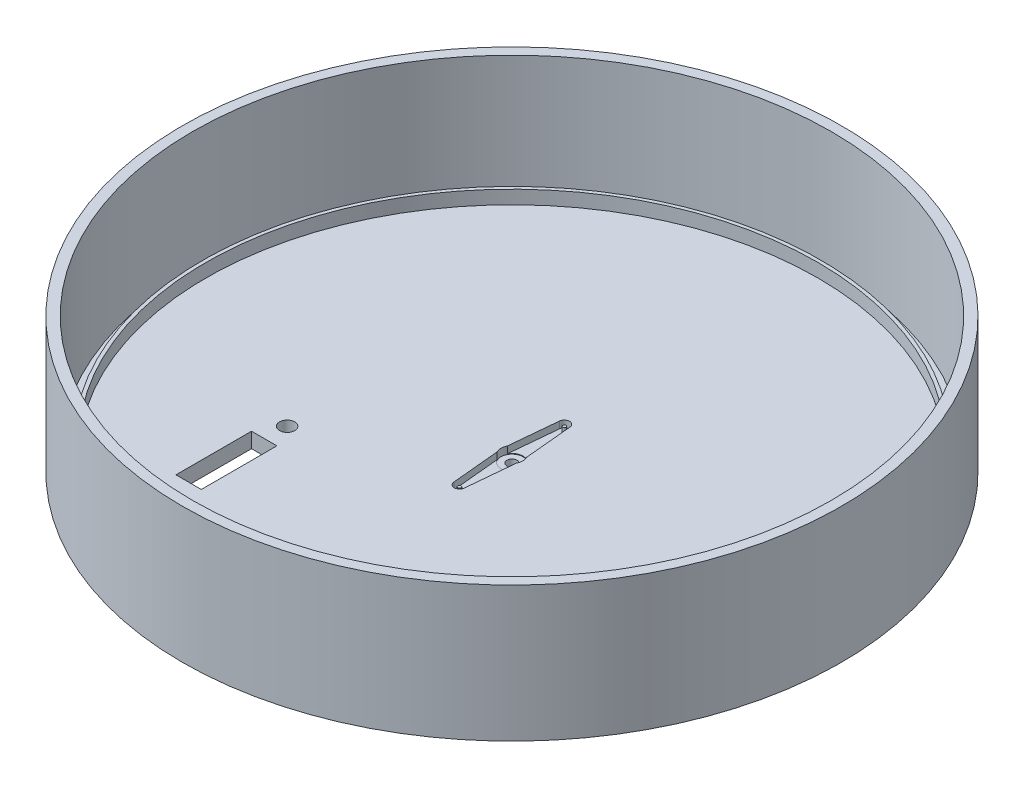
ISO-10303-21;
HEADER;
FILE_DESCRIPTION(('STEP AP214'),'2;1');
FILE_NAME('part.step','',(''),(''),'','','');
FILE_SCHEMA(('AUTOMOTIVE_DESIGN { 1 0 10303 214 1 1 1 1 }'));
ENDSEC;
DATA;
#1=APPLICATION_CONTEXT('core data for automotive mechanical design processes');
#2=APPLICATION_PROTOCOL_DEFINITION('international standard','automotive_design',2000,#1);
#3=PRODUCT_CONTEXT('',#1,'mechanical');
#4=PRODUCT('Part','Part','',(#3));
#5=PRODUCT_RELATED_PRODUCT_CATEGORY('part','',(#4));
#6=PRODUCT_DEFINITION_FORMATION('','',#4);
#7=PRODUCT_DEFINITION_CONTEXT('part definition',#1,'design');
#8=PRODUCT_DEFINITION('design','',#6,#7);
#9=PRODUCT_DEFINITION_SHAPE('','',#8);
#10=(LENGTH_UNIT() NAMED_UNIT(*) SI_UNIT(.MILLI.,.METRE.));
#11=(NAMED_UNIT(*) PLANE_ANGLE_UNIT() SI_UNIT($,.RADIAN.));
#12=(NAMED_UNIT(*) SI_UNIT($,.STERADIAN.) SOLID_ANGLE_UNIT());
#13=UNCERTAINTY_MEASURE_WITH_UNIT(LENGTH_MEASURE(1.E-05),#10,'distance_accuracy_value','');
#14=(GEOMETRIC_REPRESENTATION_CONTEXT(3) GLOBAL_UNCERTAINTY_ASSIGNED_CONTEXT((#13)) GLOBAL_UNIT_ASSIGNED_CONTEXT((#10,
#11,#12)) REPRESENTATION_CONTEXT('',''));
#15=CARTESIAN_POINT('',(0.,0.,0.));
#16=DIRECTION('',(0.,0.,1.));
#17=DIRECTION('',(1.,0.,0.));
#18=AXIS2_PLACEMENT_3D('',#15,#16,#17);
#19=CARTESIAN_POINT('',(0.,4.5,0.));
#20=DIRECTION('',(0.,1.,0.));
#21=DIRECTION('',(0.,0.,1.));
#22=AXIS2_PLACEMENT_3D('',#19,#20,#21);
#23=PLANE('',#22);
#24=DIRECTION('',(-1.,0.,0.));
#25=VECTOR('',#24,1.);
#26=CARTESIAN_POINT('',(-37.,4.5,54.8972675047795));
#27=LINE('',#26,#25);
#28=CARTESIAN_POINT('',(-37.,4.5,54.8972675047795));
#29=VERTEX_POINT('',#28);
#30=CARTESIAN_POINT('',(-44.5,4.5,54.8972675047795));
#31=VERTEX_POINT('',#30);
#32=EDGE_CURVE('E212',#29,#31,#27,.T.);
#33=ORIENTED_EDGE('',*,*,#32,.T.);
#34=DIRECTION('',(0.,0.,-1.));
#35=VECTOR('',#34,1.);
#36=CARTESIAN_POINT('',(-44.5,4.5,54.8972675047795));
#37=LINE('',#36,#35);
#38=CARTESIAN_POINT('',(-44.5,4.5,32.5372675047795));
#39=VERTEX_POINT('',#38);
#40=EDGE_CURVE('E191',#31,#39,#37,.T.);
#41=ORIENTED_EDGE('',*,*,#40,.T.);
#42=DIRECTION('',(-1.,0.,0.));
#43=VECTOR('',#42,1.);
#44=CARTESIAN_POINT('',(-37.,4.5,32.5372675047795));
#45=LINE('',#44,#43);
#46=CARTESIAN_POINT('',(-37.,4.5,32.5372675047795));
#47=VERTEX_POINT('',#46);
#48=EDGE_CURVE('E218',#47,#39,#45,.T.);
#49=ORIENTED_EDGE('',*,*,#48,.F.);
#50=DIRECTION('',(0.,0.,1.));
#51=VECTOR('',#50,1.);
#52=CARTESIAN_POINT('',(-37.,4.5,32.5372675047795));
#53=LINE('',#52,#51);
#54=EDGE_CURVE('E215',#47,#29,#53,.T.);
#55=ORIENTED_EDGE('',*,*,#54,.T.);
#56=EDGE_LOOP('',(#33,#41,#49,#55));
#57=FACE_BOUND('',#56,.T.);
#58=CARTESIAN_POINT('',(40.5,4.5,64.));
#59=DIRECTION('',(0.,1.,0.));
#60=DIRECTION('',(0.,0.,1.));
#61=AXIS2_PLACEMENT_3D('',#58,#59,#60);
#62=CIRCLE('',#61,2.25000000000001);
#63=CARTESIAN_POINT('',(40.5,4.5,66.25));
#64=VERTEX_POINT('',#63);
#65=EDGE_CURVE('E220',#64,#64,#62,.T.);
#66=ORIENTED_EDGE('',*,*,#65,.F.);
#67=EDGE_LOOP('',(#66));
#68=FACE_BOUND('',#67,.T.);
#69=CARTESIAN_POINT('',(40.5,4.5,26.));
#70=DIRECTION('',(0.,1.,0.));
#71=DIRECTION('',(0.,0.,1.));
#72=AXIS2_PLACEMENT_3D('',#69,#70,#71);
#73=CIRCLE('',#72,2.25);
#74=CARTESIAN_POINT('',(40.5,4.5,28.25));
#75=VERTEX_POINT('',#74);
#76=EDGE_CURVE('E227',#75,#75,#73,.F.);
#77=ORIENTED_EDGE('',*,*,#76,.T.);
#78=EDGE_LOOP('',(#77));
#79=FACE_BOUND('',#78,.T.);
#80=CARTESIAN_POINT('',(0.,4.5,0.));
#81=DIRECTION('',(0.,1.,0.));
#82=DIRECTION('',(0.,0.,1.));
#83=AXIS2_PLACEMENT_3D('',#80,#81,#82);
#84=CIRCLE('',#83,3.25);
#85=CARTESIAN_POINT('',(2.8699087192043,4.5,1.52516357923835));
#86=VERTEX_POINT('',#85);
#87=CARTESIAN_POINT('',(2.8699087192043,4.5,-1.52516357923835));
#88=VERTEX_POINT('',#87);
#89=EDGE_CURVE('E274',#86,#88,#84,.T.);
#90=ORIENTED_EDGE('',*,*,#89,.F.);
#91=DIRECTION('',(0.0935483870967743,0.,-0.995614734358423));
#92=VECTOR('',#91,1.);
#93=CARTESIAN_POINT('',(2.8699087192043,4.5,1.52516357923835));
#94=LINE('',#93,#92);
#95=CARTESIAN_POINT('',(1.54320283825555,4.5,15.645));
#96=VERTEX_POINT('',#95);
#97=EDGE_CURVE('E279',#96,#86,#94,.T.);
#98=ORIENTED_EDGE('',*,*,#97,.F.);
#99=CARTESIAN_POINT('',(0.,4.5,15.5));
#100=DIRECTION('',(0.,1.,0.));
#101=DIRECTION('',(0.,0.,-1.));
#102=AXIS2_PLACEMENT_3D('',#99,#100,#101);
#103=CIRCLE('',#102,1.55);
#104=CARTESIAN_POINT('',(-1.54320283825555,4.5,15.645));
#105=VERTEX_POINT('',#104);
#106=EDGE_CURVE('E311',#105,#96,#103,.T.);
#107=ORIENTED_EDGE('',*,*,#106,.F.);
#108=DIRECTION('',(0.0935483870967743,0.,0.995614734358422));
#109=VECTOR('',#108,1.);
#110=CARTESIAN_POINT('',(-2.8699087192043,4.5,1.52516357923835));
#111=LINE('',#110,#109);
#112=CARTESIAN_POINT('',(-2.8699087192043,4.5,1.52516357923835));
#113=VERTEX_POINT('',#112);
#114=EDGE_CURVE('E308',#113,#105,#111,.T.);
#115=ORIENTED_EDGE('',*,*,#114,.F.);
#116=CARTESIAN_POINT('',(0.,4.5,0.));
#117=DIRECTION('',(0.,1.,0.));
#118=DIRECTION('',(0.,0.,1.));
#119=AXIS2_PLACEMENT_3D('',#116,#117,#118);
#120=CIRCLE('',#119,3.25);
#121=CARTESIAN_POINT('',(-2.8699087192043,4.5,-1.52516357923835));
#122=VERTEX_POINT('',#121);
#123=EDGE_CURVE('E305',#122,#113,#120,.T.);
#124=ORIENTED_EDGE('',*,*,#123,.F.);
#125=DIRECTION('',(-0.0935483870967743,0.,0.995614734358422));
#126=VECTOR('',#125,1.);
#127=CARTESIAN_POINT('',(-2.8699087192043,4.5,-1.52516357923835));
#128=LINE('',#127,#126);
#129=CARTESIAN_POINT('',(-1.54320283825555,4.5,-15.645));
#130=VERTEX_POINT('',#129);
#131=EDGE_CURVE('E302',#130,#122,#128,.T.);
#132=ORIENTED_EDGE('',*,*,#131,.F.);
#133=CARTESIAN_POINT('',(0.,4.5,-15.5));
#134=DIRECTION('',(0.,1.,0.));
#135=DIRECTION('',(0.,0.,1.));
#136=AXIS2_PLACEMENT_3D('',#133,#134,#135);
#137=CIRCLE('',#136,1.55);
#138=CARTESIAN_POINT('',(1.54320283825556,4.5,-15.645));
#139=VERTEX_POINT('',#138);
#140=EDGE_CURVE('E299',#139,#130,#137,.T.);
#141=ORIENTED_EDGE('',*,*,#140,.F.);
#142=DIRECTION('',(-0.0935483870967743,0.,-0.995614734358423));
#143=VECTOR('',#142,1.);
#144=CARTESIAN_POINT('',(2.8699087192043,4.5,-1.52516357923835));
#145=LINE('',#144,#143);
#146=EDGE_CURVE('E296',#88,#139,#145,.T.);
#147=ORIENTED_EDGE('',*,*,#146,.F.);
#148=EDGE_LOOP('',(#90,#98,#107,#115,#124,#132,#141,#147));
#149=FACE_BOUND('',#148,.T.);
#150=CARTESIAN_POINT('',(0.,4.5,0.));
#151=DIRECTION('',(0.,1.,0.));
#152=DIRECTION('',(0.,0.,1.));
#153=AXIS2_PLACEMENT_3D('',#150,#151,#152);
#154=CIRCLE('',#153,90.5);
#155=CARTESIAN_POINT('',(0.,4.5,90.5));
#156=VERTEX_POINT('',#155);
#157=EDGE_CURVE('E11',#156,#156,#154,.F.);
#158=ORIENTED_EDGE('',*,*,#157,.F.);
#159=EDGE_LOOP('',(#158));
#160=FACE_BOUND('',#159,.T.);
#161=CARTESIAN_POINT('',(-40.5,4.5,64.));
#162=DIRECTION('',(0.,1.,0.));
#163=DIRECTION('',(0.,0.,1.));
#164=AXIS2_PLACEMENT_3D('',#161,#162,#163);
#165=CIRCLE('',#164,2.25000000000001);
#166=CARTESIAN_POINT('',(-40.5,4.5,66.25));
#167=VERTEX_POINT('',#166);
#168=EDGE_CURVE('E224',#167,#167,#165,.F.);
#169=ORIENTED_EDGE('',*,*,#168,.T.);
#170=EDGE_LOOP('',(#169));
#171=FACE_BOUND('',#170,.T.);
#172=CARTESIAN_POINT('',(-40.5,4.5,26.));
#173=DIRECTION('',(0.,1.,0.));
#174=DIRECTION('',(0.,0.,1.));
#175=AXIS2_PLACEMENT_3D('',#172,#173,#174);
#176=CIRCLE('',#175,2.25);
#177=CARTESIAN_POINT('',(-40.5,4.5,28.25));
#178=VERTEX_POINT('',#177);
#179=EDGE_CURVE('E170',#178,#178,#176,.T.);
#180=ORIENTED_EDGE('',*,*,#179,.F.);
#181=EDGE_LOOP('',(#180));
#182=FACE_BOUND('',#181,.T.);
#183=DIRECTION('',(1.,0.,0.));
#184=VECTOR('',#183,1.);
#185=CARTESIAN_POINT('',(0.,4.5,32.5372675047795));
#186=LINE('',#185,#184);
#187=CARTESIAN_POINT('',(37.,4.5,32.5372675047795));
#188=VERTEX_POINT('',#187);
#189=CARTESIAN_POINT('',(44.5,4.5,32.5372675047795));
#190=VERTEX_POINT('',#189);
#191=EDGE_CURVE('E174',#188,#190,#186,.T.);
#192=ORIENTED_EDGE('',*,*,#191,.T.);
#193=DIRECTION('',(0.,0.,-1.));
#194=VECTOR('',#193,1.);
#195=CARTESIAN_POINT('',(44.5,4.5,0.));
#196=LINE('',#195,#194);
#197=CARTESIAN_POINT('',(44.5,4.5,54.8972675047795));
#198=VERTEX_POINT('',#197);
#199=EDGE_CURVE('E156',#198,#190,#196,.T.);
#200=ORIENTED_EDGE('',*,*,#199,.F.);
#201=DIRECTION('',(1.,0.,0.));
#202=VECTOR('',#201,1.);
#203=CARTESIAN_POINT('',(0.,4.5,54.8972675047795));
#204=LINE('',#203,#202);
#205=CARTESIAN_POINT('',(37.,4.5,54.8972675047795));
#206=VERTEX_POINT('',#205);
#207=EDGE_CURVE('E167',#206,#198,#204,.T.);
#208=ORIENTED_EDGE('',*,*,#207,.F.);
#209=DIRECTION('',(0.,0.,1.));
#210=VECTOR('',#209,1.);
#211=CARTESIAN_POINT('',(37.,4.5,0.));
#212=LINE('',#211,#210);
#213=EDGE_CURVE('E54',#188,#206,#212,.T.);
#214=ORIENTED_EDGE('',*,*,#213,.F.);
#215=EDGE_LOOP('',(#192,#200,#208,#214));
#216=FACE_BOUND('',#215,.T.);
#217=ADVANCED_FACE('F39',(#57,#68,#79,#149,#160,#171,#182,#216),#23,.T.);
#218=CARTESIAN_POINT('',(0.,0.,0.));
#219=DIRECTION('',(0.,1.,0.));
#220=DIRECTION('',(0.,0.,1.));
#221=AXIS2_PLACEMENT_3D('',#218,#219,#220);
#222=PLANE('',#221);
#223=CARTESIAN_POINT('',(-40.5,0.,26.));
#224=DIRECTION('',(0.,1.,0.));
#225=DIRECTION('',(0.,0.,1.));
#226=AXIS2_PLACEMENT_3D('',#223,#224,#225);
#227=CIRCLE('',#226,2.25);
#228=CARTESIAN_POINT('',(-40.5,0.,28.25));
#229=VERTEX_POINT('',#228);
#230=EDGE_CURVE('E233',#229,#229,#227,.T.);
#231=ORIENTED_EDGE('',*,*,#230,.T.);
#232=EDGE_LOOP('',(#231));
#233=FACE_BOUND('',#232,.T.);
#234=CARTESIAN_POINT('',(40.5,0.,64.));
#235=DIRECTION('',(0.,1.,0.));
#236=DIRECTION('',(0.,0.,1.));
#237=AXIS2_PLACEMENT_3D('',#234,#235,#236);
#238=CIRCLE('',#237,2.25000000000001);
#239=CARTESIAN_POINT('',(40.5,0.,66.25));
#240=VERTEX_POINT('',#239);
#241=EDGE_CURVE('E223',#240,#240,#238,.T.);
#242=ORIENTED_EDGE('',*,*,#241,.T.);
#243=EDGE_LOOP('',(#242));
#244=FACE_BOUND('',#243,.T.);
#245=CARTESIAN_POINT('',(0.,0.,0.));
#246=DIRECTION('',(0.,1.,0.));
#247=DIRECTION('',(0.,0.,1.));
#248=AXIS2_PLACEMENT_3D('',#245,#246,#247);
#249=CIRCLE('',#248,97.5);
#250=CARTESIAN_POINT('',(0.,0.,97.5));
#251=VERTEX_POINT('',#250);
#252=EDGE_CURVE('E338',#251,#251,#249,.T.);
#253=ORIENTED_EDGE('',*,*,#252,.F.);
#254=EDGE_LOOP('',(#253));
#255=FACE_BOUND('',#254,.T.);
#256=CARTESIAN_POINT('',(0.,0.,0.));
#257=DIRECTION('',(0.,-1.,0.));
#258=DIRECTION('',(0.,0.,-1.));
#259=AXIS2_PLACEMENT_3D('',#256,#257,#258);
#260=CIRCLE('',#259,1.5);
#261=CARTESIAN_POINT('',(0.,0.,-1.5));
#262=VERTEX_POINT('',#261);
#263=EDGE_CURVE('E271',#262,#262,#260,.T.);
#264=ORIENTED_EDGE('',*,*,#263,.F.);
#265=EDGE_LOOP('',(#264));
#266=FACE_BOUND('',#265,.T.);
#267=CARTESIAN_POINT('',(40.5,0.,26.));
#268=DIRECTION('',(0.,-1.,0.));
#269=DIRECTION('',(0.,0.,-1.));
#270=AXIS2_PLACEMENT_3D('',#267,#268,#269);
#271=CIRCLE('',#270,2.25);
#272=CARTESIAN_POINT('',(40.5,0.,23.75));
#273=VERTEX_POINT('',#272);
#274=EDGE_CURVE('E238',#273,#273,#271,.T.);
#275=ORIENTED_EDGE('',*,*,#274,.F.);
#276=EDGE_LOOP('',(#275));
#277=FACE_BOUND('',#276,.T.);
#278=CARTESIAN_POINT('',(-40.5,0.,64.));
#279=DIRECTION('',(0.,-1.,0.));
#280=DIRECTION('',(0.,0.,-1.));
#281=AXIS2_PLACEMENT_3D('',#278,#279,#280);
#282=CIRCLE('',#281,2.25000000000001);
#283=CARTESIAN_POINT('',(-40.5,0.,61.75));
#284=VERTEX_POINT('',#283);
#285=EDGE_CURVE('E230',#284,#284,#282,.T.);
#286=ORIENTED_EDGE('',*,*,#285,.F.);
#287=EDGE_LOOP('',(#286));
#288=FACE_BOUND('',#287,.T.);
#289=DIRECTION('',(0.,0.,-1.));
#290=VECTOR('',#289,1.);
#291=CARTESIAN_POINT('',(-44.5,0.,54.8972675047795));
#292=LINE('',#291,#290);
#293=CARTESIAN_POINT('',(-44.5,0.,54.8972675047795));
#294=VERTEX_POINT('',#293);
#295=CARTESIAN_POINT('',(-44.5,0.,32.5372675047795));
#296=VERTEX_POINT('',#295);
#297=EDGE_CURVE('E208',#294,#296,#292,.T.);
#298=ORIENTED_EDGE('',*,*,#297,.F.);
#299=DIRECTION('',(-1.,0.,0.));
#300=VECTOR('',#299,1.);
#301=CARTESIAN_POINT('',(-37.,0.,54.8972675047795));
#302=LINE('',#301,#300);
#303=CARTESIAN_POINT('',(-37.,0.,54.8972675047795));
#304=VERTEX_POINT('',#303);
#305=EDGE_CURVE('E210',#304,#294,#302,.T.);
#306=ORIENTED_EDGE('',*,*,#305,.F.);
#307=DIRECTION('',(0.,0.,1.));
#308=VECTOR('',#307,1.);
#309=CARTESIAN_POINT('',(-37.,0.,32.5372675047795));
#310=LINE('',#309,#308);
#311=CARTESIAN_POINT('',(-37.,0.,32.5372675047795));
#312=VERTEX_POINT('',#311);
#313=EDGE_CURVE('E198',#312,#304,#310,.T.);
#314=ORIENTED_EDGE('',*,*,#313,.F.);
#315=DIRECTION('',(-1.,0.,0.));
#316=VECTOR('',#315,1.);
#317=CARTESIAN_POINT('',(-37.,0.,32.5372675047795));
#318=LINE('',#317,#316);
#319=EDGE_CURVE('E205',#312,#296,#318,.T.);
#320=ORIENTED_EDGE('',*,*,#319,.T.);
#321=EDGE_LOOP('',(#298,#306,#314,#320));
#322=FACE_BOUND('',#321,.T.);
#323=DIRECTION('',(0.,0.,-1.));
#324=VECTOR('',#323,1.);
#325=CARTESIAN_POINT('',(44.5,0.,0.));
#326=LINE('',#325,#324);
#327=CARTESIAN_POINT('',(44.5,0.,54.8972675047795));
#328=VERTEX_POINT('',#327);
#329=CARTESIAN_POINT('',(44.5,0.,32.5372675047795));
#330=VERTEX_POINT('',#329);
#331=EDGE_CURVE('E159',#328,#330,#326,.T.);
#332=ORIENTED_EDGE('',*,*,#331,.T.);
#333=DIRECTION('',(1.,0.,0.));
#334=VECTOR('',#333,1.);
#335=CARTESIAN_POINT('',(0.,0.,32.5372675047795));
#336=LINE('',#335,#334);
#337=CARTESIAN_POINT('',(37.,0.,32.5372675047795));
#338=VERTEX_POINT('',#337);
#339=EDGE_CURVE('E164',#338,#330,#336,.T.);
#340=ORIENTED_EDGE('',*,*,#339,.F.);
#341=DIRECTION('',(0.,0.,1.));
#342=VECTOR('',#341,1.);
#343=CARTESIAN_POINT('',(37.,0.,0.));
#344=LINE('',#343,#342);
#345=CARTESIAN_POINT('',(37.,0.,54.8972675047795));
#346=VERTEX_POINT('',#345);
#347=EDGE_CURVE('E182',#338,#346,#344,.T.);
#348=ORIENTED_EDGE('',*,*,#347,.T.);
#349=DIRECTION('',(1.,0.,0.));
#350=VECTOR('',#349,1.);
#351=CARTESIAN_POINT('',(0.,0.,54.8972675047795));
#352=LINE('',#351,#350);
#353=EDGE_CURVE('E176',#346,#328,#352,.T.);
#354=ORIENTED_EDGE('',*,*,#353,.T.);
#355=EDGE_LOOP('',(#332,#340,#348,#354));
#356=FACE_BOUND('',#355,.T.);
#357=ADVANCED_FACE('F358',(#233,#244,#255,#266,#277,#288,#322,#356),#222,.F.);
#358=CARTESIAN_POINT('',(0.,2.5,0.));
#359=DIRECTION('',(0.,1.,0.));
#360=DIRECTION('',(0.,0.,1.));
#361=AXIS2_PLACEMENT_3D('',#358,#359,#360);
#362=PLANE('',#361);
#363=CARTESIAN_POINT('',(0.,2.5,-15.5));
#364=DIRECTION('',(0.,1.,0.));
#365=DIRECTION('',(0.,0.,1.));
#366=AXIS2_PLACEMENT_3D('',#363,#364,#365);
#367=CIRCLE('',#366,0.48);
#368=CARTESIAN_POINT('',(0.,2.5,-15.02));
#369=VERTEX_POINT('',#368);
#370=EDGE_CURVE('E256',#369,#369,#367,.T.);
#371=ORIENTED_EDGE('',*,*,#370,.F.);
#372=EDGE_LOOP('',(#371));
#373=FACE_BOUND('',#372,.T.);
#374=CARTESIAN_POINT('',(0.,2.5,0.));
#375=DIRECTION('',(0.,1.,0.));
#376=DIRECTION('',(0.,0.,1.));
#377=AXIS2_PLACEMENT_3D('',#374,#375,#376);
#378=CIRCLE('',#377,3.25);
#379=CARTESIAN_POINT('',(2.8699087192043,2.5,-1.52516357923834));
#380=VERTEX_POINT('',#379);
#381=CARTESIAN_POINT('',(-2.8699087192043,2.5,-1.52516357923835));
#382=VERTEX_POINT('',#381);
#383=EDGE_CURVE('E269',#380,#382,#378,.T.);
#384=ORIENTED_EDGE('',*,*,#383,.F.);
#385=DIRECTION('',(-0.0935483870967743,0.,-0.995614734358423));
#386=VECTOR('',#385,1.);
#387=CARTESIAN_POINT('',(2.8699087192043,2.5,-1.52516357923835));
#388=LINE('',#387,#386);
#389=CARTESIAN_POINT('',(1.54320283825556,2.5,-15.645));
#390=VERTEX_POINT('',#389);
#391=EDGE_CURVE('E275',#380,#390,#388,.T.);
#392=ORIENTED_EDGE('',*,*,#391,.T.);
#393=CARTESIAN_POINT('',(0.,2.5,-15.5));
#394=DIRECTION('',(0.,1.,0.));
#395=DIRECTION('',(0.,0.,1.));
#396=AXIS2_PLACEMENT_3D('',#393,#394,#395);
#397=CIRCLE('',#396,1.55);
#398=CARTESIAN_POINT('',(-1.54320283825555,2.5,-15.645));
#399=VERTEX_POINT('',#398);
#400=EDGE_CURVE('E278',#390,#399,#397,.T.);
#401=ORIENTED_EDGE('',*,*,#400,.T.);
#402=DIRECTION('',(-0.0935483870967743,0.,0.995614734358422));
#403=VECTOR('',#402,1.);
#404=CARTESIAN_POINT('',(-2.8699087192043,2.5,-1.52516357923835));
#405=LINE('',#404,#403);
#406=EDGE_CURVE('E282',#399,#382,#405,.T.);
#407=ORIENTED_EDGE('',*,*,#406,.T.);
#408=EDGE_LOOP('',(#384,#392,#401,#407));
#409=FACE_BOUND('',#408,.T.);
#410=ADVANCED_FACE('F349',(#373,#409),#362,.T.);
#411=CARTESIAN_POINT('',(0.,40.001,0.));
#412=DIRECTION('',(0.,-1.,0.));
#413=DIRECTION('',(0.,0.,-1.));
#414=AXIS2_PLACEMENT_3D('',#411,#412,#413);
#415=CYLINDRICAL_SURFACE('',#414,1.5);
#416=ORIENTED_EDGE('',*,*,#263,.T.);
#417=EDGE_LOOP('',(#416));
#418=FACE_BOUND('',#417,.T.);
#419=CARTESIAN_POINT('',(0.,2.3,0.));
#420=DIRECTION('',(0.,1.,0.));
#421=DIRECTION('',(0.,0.,1.));
#422=AXIS2_PLACEMENT_3D('',#419,#420,#421);
#423=CIRCLE('',#422,1.5);
#424=CARTESIAN_POINT('',(0.,2.3,1.5));
#425=VERTEX_POINT('',#424);
#426=EDGE_CURVE('E268',#425,#425,#423,.F.);
#427=ORIENTED_EDGE('',*,*,#426,.F.);
#428=EDGE_LOOP('',(#427));
#429=FACE_BOUND('',#428,.T.);
#430=ADVANCED_FACE('F347',(#418,#429),#415,.F.);
#431=CARTESIAN_POINT('',(0.,40.,0.));
#432=DIRECTION('',(0.,-1.,0.));
#433=DIRECTION('',(0.,0.,-1.));
#434=AXIS2_PLACEMENT_3D('',#431,#432,#433);
#435=CYLINDRICAL_SURFACE('',#434,97.5);
#436=CARTESIAN_POINT('',(0.,40.,0.));
#437=DIRECTION('',(0.,1.,0.));
#438=DIRECTION('',(0.,0.,1.));
#439=AXIS2_PLACEMENT_3D('',#436,#437,#438);
#440=CIRCLE('',#439,97.5);
#441=CARTESIAN_POINT('',(0.,40.,97.5));
#442=VERTEX_POINT('',#441);
#443=EDGE_CURVE('E47',#442,#442,#440,.T.);
#444=ORIENTED_EDGE('',*,*,#443,.F.);
#445=EDGE_LOOP('',(#444));
#446=FACE_BOUND('',#445,.T.);
#447=ORIENTED_EDGE('',*,*,#252,.T.);
#448=EDGE_LOOP('',(#447));
#449=FACE_BOUND('',#448,.T.);
#450=ADVANCED_FACE('F41',(#446,#449),#435,.T.);
#451=CARTESIAN_POINT('',(0.,40.,0.));
#452=DIRECTION('',(0.,1.,0.));
#453=DIRECTION('',(0.,0.,1.));
#454=AXIS2_PLACEMENT_3D('',#451,#452,#453);
#455=PLANE('',#454);
#456=CARTESIAN_POINT('',(0.,40.,0.));
#457=DIRECTION('',(0.,1.,0.));
#458=DIRECTION('',(0.,0.,1.));
#459=AXIS2_PLACEMENT_3D('',#456,#457,#458);
#460=CIRCLE('',#459,94.5);
#461=CARTESIAN_POINT('',(0.,40.,94.5));
#462=VERTEX_POINT('',#461);
#463=EDGE_CURVE('E335',#462,#462,#460,.T.);
#464=ORIENTED_EDGE('',*,*,#463,.F.);
#465=EDGE_LOOP('',(#464));
#466=FACE_BOUND('',#465,.T.);
#467=ORIENTED_EDGE('',*,*,#443,.T.);
#468=EDGE_LOOP('',(#467));
#469=FACE_BOUND('',#468,.T.);
#470=ADVANCED_FACE('F356',(#466,#469),#455,.T.);
#471=CARTESIAN_POINT('',(0.,40.,0.));
#472=DIRECTION('',(0.,-1.,0.));
#473=DIRECTION('',(0.,0.,-1.));
#474=AXIS2_PLACEMENT_3D('',#471,#472,#473);
#475=CYLINDRICAL_SURFACE('',#474,94.5);
#476=ORIENTED_EDGE('',*,*,#463,.T.);
#477=EDGE_LOOP('',(#476));
#478=FACE_BOUND('',#477,.T.);
#479=CARTESIAN_POINT('',(0.,4.5,0.));
#480=DIRECTION('',(0.,1.,0.));
#481=DIRECTION('',(0.,0.,1.));
#482=AXIS2_PLACEMENT_3D('',#479,#480,#481);
#483=CIRCLE('',#482,94.5);
#484=CARTESIAN_POINT('',(0.,4.5,94.5));
#485=VERTEX_POINT('',#484);
#486=EDGE_CURVE('E318',#485,#485,#483,.T.);
#487=ORIENTED_EDGE('',*,*,#486,.F.);
#488=EDGE_LOOP('',(#487));
#489=FACE_BOUND('',#488,.T.);
#490=ADVANCED_FACE('F376',(#478,#489),#475,.F.);
#491=CARTESIAN_POINT('',(0.,4.5,0.));
#492=DIRECTION('',(0.,1.,0.));
#493=DIRECTION('',(0.,0.,1.));
#494=AXIS2_PLACEMENT_3D('',#491,#492,#493);
#495=CIRCLE('',#494,91.5);
#496=CARTESIAN_POINT('',(0.,4.5,91.5));
#497=VERTEX_POINT('',#496);
#498=EDGE_CURVE('E246',#497,#497,#495,.T.);
#499=ORIENTED_EDGE('',*,*,#498,.F.);
#500=EDGE_LOOP('',(#499));
#501=FACE_BOUND('',#500,.T.);
#502=ORIENTED_EDGE('',*,*,#486,.T.);
#503=EDGE_LOOP('',(#502));
#504=FACE_BOUND('',#503,.T.);
#505=ADVANCED_FACE('F366',(#501,#504),#23,.T.);
#506=CARTESIAN_POINT('',(0.,2.5,0.));
#507=DIRECTION('',(0.,1.,0.));
#508=DIRECTION('',(0.,0.,1.));
#509=AXIS2_PLACEMENT_3D('',#506,#507,#508);
#510=CYLINDRICAL_SURFACE('',#509,3.25);
#511=ORIENTED_EDGE('',*,*,#89,.T.);
#512=DIRECTION('',(0.,1.,0.));
#513=VECTOR('',#512,1.);
#514=CARTESIAN_POINT('',(2.8699087192043,2.5,-1.52516357923835));
#515=LINE('',#514,#513);
#516=EDGE_CURVE('E294',#380,#88,#515,.T.);
#517=ORIENTED_EDGE('',*,*,#516,.F.);
#518=ORIENTED_EDGE('',*,*,#383,.T.);
#519=DIRECTION('',(0.,1.,0.));
#520=VECTOR('',#519,1.);
#521=CARTESIAN_POINT('',(-2.8699087192043,2.5,-1.52516357923835));
#522=LINE('',#521,#520);
#523=EDGE_CURVE('E325',#382,#122,#522,.T.);
#524=ORIENTED_EDGE('',*,*,#523,.T.);
#525=ORIENTED_EDGE('',*,*,#123,.T.);
#526=DIRECTION('',(0.,1.,0.));
#527=VECTOR('',#526,1.);
#528=CARTESIAN_POINT('',(-2.8699087192043,2.5,1.52516357923835));
#529=LINE('',#528,#527);
#530=CARTESIAN_POINT('',(-2.8699087192043,2.5,1.52516357923835));
#531=VERTEX_POINT('',#530);
#532=EDGE_CURVE('E323',#531,#113,#529,.T.);
#533=ORIENTED_EDGE('',*,*,#532,.F.);
#534=CARTESIAN_POINT('',(2.8699087192043,2.5,1.52516357923834));
#535=VERTEX_POINT('',#534);
#536=EDGE_CURVE('E262',#531,#535,#378,.T.);
#537=ORIENTED_EDGE('',*,*,#536,.T.);
#538=DIRECTION('',(0.,1.,0.));
#539=VECTOR('',#538,1.);
#540=CARTESIAN_POINT('',(2.8699087192043,2.5,1.52516357923835));
#541=LINE('',#540,#539);
#542=EDGE_CURVE('E316',#535,#86,#541,.T.);
#543=ORIENTED_EDGE('',*,*,#542,.T.);
#544=EDGE_LOOP('',(#511,#517,#518,#524,#525,#533,#537,#543));
#545=FACE_BOUND('',#544,.T.);
#546=CARTESIAN_POINT('',(0.,2.3,0.));
#547=DIRECTION('',(0.,1.,0.));
#548=DIRECTION('',(0.,0.,1.));
#549=AXIS2_PLACEMENT_3D('',#546,#547,#548);
#550=CIRCLE('',#549,3.25);
#551=CARTESIAN_POINT('',(0.,2.3,3.25));
#552=VERTEX_POINT('',#551);
#553=EDGE_CURVE('E265',#552,#552,#550,.T.);
#554=ORIENTED_EDGE('',*,*,#553,.F.);
#555=EDGE_LOOP('',(#554));
#556=FACE_BOUND('',#555,.T.);
#557=ADVANCED_FACE('F375',(#545,#556),#510,.F.);
#558=CARTESIAN_POINT('',(2.8699087192043,2.5,1.52516357923835));
#559=DIRECTION('',(0.995614734358423,0.,0.0935483870967743));
#560=DIRECTION('',(0.0935483870967743,0.,-0.995614734358423));
#561=AXIS2_PLACEMENT_3D('',#558,#559,#560);
#562=PLANE('',#561);
#563=ORIENTED_EDGE('',*,*,#97,.T.);
#564=ORIENTED_EDGE('',*,*,#542,.F.);
#565=DIRECTION('',(0.0935483870967743,0.,-0.995614734358423));
#566=VECTOR('',#565,1.);
#567=CARTESIAN_POINT('',(2.8699087192043,2.5,1.52516357923835));
#568=LINE('',#567,#566);
#569=CARTESIAN_POINT('',(1.54320283825555,2.5,15.645));
#570=VERTEX_POINT('',#569);
#571=EDGE_CURVE('E291',#570,#535,#568,.T.);
#572=ORIENTED_EDGE('',*,*,#571,.F.);
#573=DIRECTION('',(0.,1.,0.));
#574=VECTOR('',#573,1.);
#575=CARTESIAN_POINT('',(1.54320283825555,2.5,15.645));
#576=LINE('',#575,#574);
#577=EDGE_CURVE('E319',#570,#96,#576,.T.);
#578=ORIENTED_EDGE('',*,*,#577,.T.);
#579=EDGE_LOOP('',(#563,#564,#572,#578));
#580=FACE_BOUND('',#579,.T.);
#581=ADVANCED_FACE('F382',(#580),#562,.F.);
#582=CARTESIAN_POINT('',(0.,2.5,15.5));
#583=DIRECTION('',(0.,1.,0.));
#584=DIRECTION('',(0.,0.,1.));
#585=AXIS2_PLACEMENT_3D('',#582,#583,#584);
#586=CYLINDRICAL_SURFACE('',#585,1.55);
#587=ORIENTED_EDGE('',*,*,#106,.T.);
#588=ORIENTED_EDGE('',*,*,#577,.F.);
#589=CARTESIAN_POINT('',(0.,2.5,15.5));
#590=DIRECTION('',(0.,1.,0.));
#591=DIRECTION('',(0.,0.,-1.));
#592=AXIS2_PLACEMENT_3D('',#589,#590,#591);
#593=CIRCLE('',#592,1.55);
#594=CARTESIAN_POINT('',(-1.54320283825555,2.5,15.645));
#595=VERTEX_POINT('',#594);
#596=EDGE_CURVE('E288',#595,#570,#593,.T.);
#597=ORIENTED_EDGE('',*,*,#596,.F.);
#598=DIRECTION('',(0.,1.,0.));
#599=VECTOR('',#598,1.);
#600=CARTESIAN_POINT('',(-1.54320283825555,2.5,15.645));
#601=LINE('',#600,#599);
#602=EDGE_CURVE('E321',#595,#105,#601,.T.);
#603=ORIENTED_EDGE('',*,*,#602,.T.);
#604=EDGE_LOOP('',(#587,#588,#597,#603));
#605=FACE_BOUND('',#604,.T.);
#606=ADVANCED_FACE('F443',(#605),#586,.F.);
#607=CARTESIAN_POINT('',(-2.8699087192043,2.5,1.52516357923835));
#608=DIRECTION('',(-0.995614734358423,0.,0.0935483870967743));
#609=DIRECTION('',(0.0935483870967743,0.,0.995614734358423));
#610=AXIS2_PLACEMENT_3D('',#607,#608,#609);
#611=PLANE('',#610);
#612=ORIENTED_EDGE('',*,*,#114,.T.);
#613=ORIENTED_EDGE('',*,*,#602,.F.);
#614=DIRECTION('',(0.0935483870967743,0.,0.995614734358422));
#615=VECTOR('',#614,1.);
#616=CARTESIAN_POINT('',(-2.8699087192043,2.5,1.52516357923835));
#617=LINE('',#616,#615);
#618=EDGE_CURVE('E285',#531,#595,#617,.T.);
#619=ORIENTED_EDGE('',*,*,#618,.F.);
#620=ORIENTED_EDGE('',*,*,#532,.T.);
#621=EDGE_LOOP('',(#612,#613,#619,#620));
#622=FACE_BOUND('',#621,.T.);
#623=ADVANCED_FACE('F447',(#622),#611,.F.);
#624=CARTESIAN_POINT('',(-2.8699087192043,2.5,-1.52516357923835));
#625=DIRECTION('',(-0.995614734358423,0.,-0.0935483870967743));
#626=DIRECTION('',(-0.0935483870967743,0.,0.995614734358423));
#627=AXIS2_PLACEMENT_3D('',#624,#625,#626);
#628=PLANE('',#627);
#629=ORIENTED_EDGE('',*,*,#131,.T.);
#630=ORIENTED_EDGE('',*,*,#523,.F.);
#631=ORIENTED_EDGE('',*,*,#406,.F.);
#632=DIRECTION('',(0.,1.,0.));
#633=VECTOR('',#632,1.);
#634=CARTESIAN_POINT('',(-1.54320283825555,2.5,-15.645));
#635=LINE('',#634,#633);
#636=EDGE_CURVE('E327',#399,#130,#635,.T.);
#637=ORIENTED_EDGE('',*,*,#636,.T.);
#638=EDGE_LOOP('',(#629,#630,#631,#637));
#639=FACE_BOUND('',#638,.T.);
#640=ADVANCED_FACE('F451',(#639),#628,.F.);
#641=CARTESIAN_POINT('',(0.,2.5,-15.5));
#642=DIRECTION('',(0.,1.,0.));
#643=DIRECTION('',(0.,0.,1.));
#644=AXIS2_PLACEMENT_3D('',#641,#642,#643);
#645=CYLINDRICAL_SURFACE('',#644,1.55);
#646=ORIENTED_EDGE('',*,*,#140,.T.);
#647=ORIENTED_EDGE('',*,*,#636,.F.);
#648=ORIENTED_EDGE('',*,*,#400,.F.);
#649=DIRECTION('',(0.,1.,0.));
#650=VECTOR('',#649,1.);
#651=CARTESIAN_POINT('',(1.54320283825556,2.5,-15.645));
#652=LINE('',#651,#650);
#653=EDGE_CURVE('E329',#390,#139,#652,.T.);
#654=ORIENTED_EDGE('',*,*,#653,.T.);
#655=EDGE_LOOP('',(#646,#647,#648,#654));
#656=FACE_BOUND('',#655,.T.);
#657=ADVANCED_FACE('F435',(#656),#645,.F.);
#658=CARTESIAN_POINT('',(2.8699087192043,2.5,-1.52516357923835));
#659=DIRECTION('',(0.995614734358423,0.,-0.0935483870967743));
#660=DIRECTION('',(-0.0935483870967743,0.,-0.995614734358423));
#661=AXIS2_PLACEMENT_3D('',#658,#659,#660);
#662=PLANE('',#661);
#663=ORIENTED_EDGE('',*,*,#146,.T.);
#664=ORIENTED_EDGE('',*,*,#653,.F.);
#665=ORIENTED_EDGE('',*,*,#391,.F.);
#666=ORIENTED_EDGE('',*,*,#516,.T.);
#667=EDGE_LOOP('',(#663,#664,#665,#666));
#668=FACE_BOUND('',#667,.T.);
#669=ADVANCED_FACE('F428',(#668),#662,.F.);
#670=CARTESIAN_POINT('',(0.,2.5,15.5));
#671=DIRECTION('',(0.,1.,0.));
#672=DIRECTION('',(0.,0.,1.));
#673=AXIS2_PLACEMENT_3D('',#670,#671,#672);
#674=CIRCLE('',#673,0.48);
#675=CARTESIAN_POINT('',(0.,2.5,15.98));
#676=VERTEX_POINT('',#675);
#677=EDGE_CURVE('E250',#676,#676,#674,.T.);
#678=ORIENTED_EDGE('',*,*,#677,.F.);
#679=EDGE_LOOP('',(#678));
#680=FACE_BOUND('',#679,.T.);
#681=ORIENTED_EDGE('',*,*,#536,.F.);
#682=ORIENTED_EDGE('',*,*,#618,.T.);
#683=ORIENTED_EDGE('',*,*,#596,.T.);
#684=ORIENTED_EDGE('',*,*,#571,.T.);
#685=EDGE_LOOP('',(#681,#682,#683,#684));
#686=FACE_BOUND('',#685,.T.);
#687=ADVANCED_FACE('F361',(#680,#686),#362,.T.);
#688=CARTESIAN_POINT('',(0.,2.3,0.));
#689=DIRECTION('',(0.,1.,0.));
#690=DIRECTION('',(0.,0.,1.));
#691=AXIS2_PLACEMENT_3D('',#688,#689,#690);
#692=PLANE('',#691);
#693=ORIENTED_EDGE('',*,*,#553,.T.);
#694=EDGE_LOOP('',(#693));
#695=FACE_BOUND('',#694,.T.);
#696=ORIENTED_EDGE('',*,*,#426,.T.);
#697=EDGE_LOOP('',(#696));
#698=FACE_BOUND('',#697,.T.);
#699=ADVANCED_FACE('F345',(#695,#698),#692,.T.);
#700=CARTESIAN_POINT('',(0.,4.,-15.5));
#701=DIRECTION('',(0.,-1.,0.));
#702=DIRECTION('',(0.,0.,-1.));
#703=AXIS2_PLACEMENT_3D('',#700,#701,#702);
#704=CYLINDRICAL_SURFACE('',#703,0.48);
#705=CARTESIAN_POINT('',(0.,4.,-15.5));
#706=DIRECTION('',(0.,1.,0.));
#707=DIRECTION('',(0.,0.,1.));
#708=AXIS2_PLACEMENT_3D('',#705,#706,#707);
#709=CIRCLE('',#708,0.48);
#710=CARTESIAN_POINT('',(0.,4.,-15.02));
#711=VERTEX_POINT('',#710);
#712=EDGE_CURVE('E259',#711,#711,#709,.T.);
#713=ORIENTED_EDGE('',*,*,#712,.F.);
#714=EDGE_LOOP('',(#713));
#715=FACE_BOUND('',#714,.T.);
#716=ORIENTED_EDGE('',*,*,#370,.T.);
#717=EDGE_LOOP('',(#716));
#718=FACE_BOUND('',#717,.T.);
#719=ADVANCED_FACE('F419',(#715,#718),#704,.T.);
#720=CARTESIAN_POINT('',(0.,4.,-15.5));
#721=DIRECTION('',(0.,1.,0.));
#722=DIRECTION('',(0.,0.,1.));
#723=AXIS2_PLACEMENT_3D('',#720,#721,#722);
#724=PLANE('',#723);
#725=ORIENTED_EDGE('',*,*,#712,.T.);
#726=EDGE_LOOP('',(#725));
#727=FACE_BOUND('',#726,.T.);
#728=ADVANCED_FACE('F415',(#727),#724,.T.);
#729=CARTESIAN_POINT('',(0.,4.,15.5));
#730=DIRECTION('',(0.,-1.,0.));
#731=DIRECTION('',(0.,0.,-1.));
#732=AXIS2_PLACEMENT_3D('',#729,#730,#731);
#733=CYLINDRICAL_SURFACE('',#732,0.48);
#734=CARTESIAN_POINT('',(0.,4.,15.5));
#735=DIRECTION('',(0.,1.,0.));
#736=DIRECTION('',(0.,0.,1.));
#737=AXIS2_PLACEMENT_3D('',#734,#735,#736);
#738=CIRCLE('',#737,0.48);
#739=CARTESIAN_POINT('',(0.,4.,15.98));
#740=VERTEX_POINT('',#739);
#741=EDGE_CURVE('E253',#740,#740,#738,.T.);
#742=ORIENTED_EDGE('',*,*,#741,.F.);
#743=EDGE_LOOP('',(#742));
#744=FACE_BOUND('',#743,.T.);
#745=ORIENTED_EDGE('',*,*,#677,.T.);
#746=EDGE_LOOP('',(#745));
#747=FACE_BOUND('',#746,.T.);
#748=ADVANCED_FACE('F411',(#744,#747),#733,.T.);
#749=CARTESIAN_POINT('',(0.,4.,15.5));
#750=DIRECTION('',(0.,1.,0.));
#751=DIRECTION('',(0.,0.,1.));
#752=AXIS2_PLACEMENT_3D('',#749,#750,#751);
#753=PLANE('',#752);
#754=ORIENTED_EDGE('',*,*,#741,.T.);
#755=EDGE_LOOP('',(#754));
#756=FACE_BOUND('',#755,.T.);
#757=ADVANCED_FACE('F404',(#756),#753,.T.);
#758=CARTESIAN_POINT('',(0.,8.5,0.));
#759=DIRECTION('',(0.,1.,0.));
#760=DIRECTION('',(0.,0.,1.));
#761=AXIS2_PLACEMENT_3D('',#758,#759,#760);
#762=PLANE('',#761);
#763=CARTESIAN_POINT('',(0.,8.5,0.));
#764=DIRECTION('',(0.,1.,0.));
#765=DIRECTION('',(0.,0.,1.));
#766=AXIS2_PLACEMENT_3D('',#763,#764,#765);
#767=CIRCLE('',#766,91.5);
#768=CARTESIAN_POINT('',(0.,8.5,91.5));
#769=VERTEX_POINT('',#768);
#770=EDGE_CURVE('E247',#769,#769,#767,.T.);
#771=ORIENTED_EDGE('',*,*,#770,.T.);
#772=EDGE_LOOP('',(#771));
#773=FACE_BOUND('',#772,.T.);
#774=CARTESIAN_POINT('',(0.,8.5,0.));
#775=DIRECTION('',(0.,1.,0.));
#776=DIRECTION('',(0.,0.,1.));
#777=AXIS2_PLACEMENT_3D('',#774,#775,#776);
#778=CIRCLE('',#777,90.5);
#779=CARTESIAN_POINT('',(0.,8.5,90.5));
#780=VERTEX_POINT('',#779);
#781=EDGE_CURVE('E241',#780,#780,#778,.T.);
#782=ORIENTED_EDGE('',*,*,#781,.F.);
#783=EDGE_LOOP('',(#782));
#784=FACE_BOUND('',#783,.T.);
#785=ADVANCED_FACE('F394',(#773,#784),#762,.T.);
#786=CARTESIAN_POINT('',(0.,8.5,0.));
#787=DIRECTION('',(0.,-1.,0.));
#788=DIRECTION('',(0.,0.,-1.));
#789=AXIS2_PLACEMENT_3D('',#786,#787,#788);
#790=CYLINDRICAL_SURFACE('',#789,91.5);
#791=ORIENTED_EDGE('',*,*,#770,.F.);
#792=EDGE_LOOP('',(#791));
#793=FACE_BOUND('',#792,.T.);
#794=ORIENTED_EDGE('',*,*,#498,.T.);
#795=EDGE_LOOP('',(#794));
#796=FACE_BOUND('',#795,.T.);
#797=ADVANCED_FACE('F391',(#793,#796),#790,.T.);
#798=CARTESIAN_POINT('',(0.,8.5,0.));
#799=DIRECTION('',(0.,-1.,0.));
#800=DIRECTION('',(0.,0.,-1.));
#801=AXIS2_PLACEMENT_3D('',#798,#799,#800);
#802=CYLINDRICAL_SURFACE('',#801,90.5);
#803=ORIENTED_EDGE('',*,*,#781,.T.);
#804=EDGE_LOOP('',(#803));
#805=FACE_BOUND('',#804,.T.);
#806=ORIENTED_EDGE('',*,*,#157,.T.);
#807=EDGE_LOOP('',(#806));
#808=FACE_BOUND('',#807,.T.);
#809=ADVANCED_FACE('F393',(#805,#808),#802,.F.);
#810=CARTESIAN_POINT('',(40.5,40.001,26.));
#811=DIRECTION('',(0.,-1.,0.));
#812=DIRECTION('',(0.,0.,-1.));
#813=AXIS2_PLACEMENT_3D('',#810,#811,#812);
#814=CYLINDRICAL_SURFACE('',#813,2.25);
#815=ORIENTED_EDGE('',*,*,#76,.F.);
#816=EDGE_LOOP('',(#815));
#817=FACE_BOUND('',#816,.T.);
#818=ORIENTED_EDGE('',*,*,#274,.T.);
#819=EDGE_LOOP('',(#818));
#820=FACE_BOUND('',#819,.T.);
#821=ADVANCED_FACE('F401',(#817,#820),#814,.F.);
#822=CARTESIAN_POINT('',(40.5,40.001,64.));
#823=DIRECTION('',(0.,-1.,0.));
#824=DIRECTION('',(0.,0.,-1.));
#825=AXIS2_PLACEMENT_3D('',#822,#823,#824);
#826=CYLINDRICAL_SURFACE('',#825,2.25000000000001);
#827=ORIENTED_EDGE('',*,*,#65,.T.);
#828=EDGE_LOOP('',(#827));
#829=FACE_BOUND('',#828,.T.);
#830=ORIENTED_EDGE('',*,*,#241,.F.);
#831=EDGE_LOOP('',(#830));
#832=FACE_BOUND('',#831,.T.);
#833=ADVANCED_FACE('F538',(#829,#832),#826,.F.);
#834=CARTESIAN_POINT('',(-40.5,40.001,64.));
#835=DIRECTION('',(0.,-1.,0.));
#836=DIRECTION('',(0.,0.,-1.));
#837=AXIS2_PLACEMENT_3D('',#834,#835,#836);
#838=CYLINDRICAL_SURFACE('',#837,2.25000000000001);
#839=ORIENTED_EDGE('',*,*,#168,.F.);
#840=EDGE_LOOP('',(#839));
#841=FACE_BOUND('',#840,.T.);
#842=ORIENTED_EDGE('',*,*,#285,.T.);
#843=EDGE_LOOP('',(#842));
#844=FACE_BOUND('',#843,.T.);
#845=ADVANCED_FACE('F491',(#841,#844),#838,.F.);
#846=CARTESIAN_POINT('',(-40.5,40.001,26.));
#847=DIRECTION('',(0.,-1.,0.));
#848=DIRECTION('',(0.,0.,-1.));
#849=AXIS2_PLACEMENT_3D('',#846,#847,#848);
#850=CYLINDRICAL_SURFACE('',#849,2.25);
#851=ORIENTED_EDGE('',*,*,#179,.T.);
#852=EDGE_LOOP('',(#851));
#853=FACE_BOUND('',#852,.T.);
#854=ORIENTED_EDGE('',*,*,#230,.F.);
#855=EDGE_LOOP('',(#854));
#856=FACE_BOUND('',#855,.T.);
#857=ADVANCED_FACE('F487',(#853,#856),#850,.F.);
#858=CARTESIAN_POINT('',(-37.,40.001,54.8972675047795));
#859=DIRECTION('',(0.,0.,1.));
#860=DIRECTION('',(1.,0.,0.));
#861=AXIS2_PLACEMENT_3D('',#858,#859,#860);
#862=PLANE('',#861);
#863=DIRECTION('',(0.,-1.,0.));
#864=VECTOR('',#863,1.);
#865=CARTESIAN_POINT('',(-37.,40.001,54.8972675047795));
#866=LINE('',#865,#864);
#867=EDGE_CURVE('E194',#29,#304,#866,.T.);
#868=ORIENTED_EDGE('',*,*,#867,.T.);
#869=ORIENTED_EDGE('',*,*,#305,.T.);
#870=DIRECTION('',(0.,-1.,0.));
#871=VECTOR('',#870,1.);
#872=CARTESIAN_POINT('',(-44.5,40.001,54.8972675047795));
#873=LINE('',#872,#871);
#874=EDGE_CURVE('E195',#31,#294,#873,.T.);
#875=ORIENTED_EDGE('',*,*,#874,.F.);
#876=ORIENTED_EDGE('',*,*,#32,.F.);
#877=EDGE_LOOP('',(#868,#869,#875,#876));
#878=FACE_BOUND('',#877,.T.);
#879=ADVANCED_FACE('F490',(#878),#862,.F.);
#880=CARTESIAN_POINT('',(-37.,40.001,32.5372675047795));
#881=DIRECTION('',(1.,0.,0.));
#882=DIRECTION('',(0.,0.,-1.));
#883=AXIS2_PLACEMENT_3D('',#880,#881,#882);
#884=PLANE('',#883);
#885=DIRECTION('',(0.,-1.,0.));
#886=VECTOR('',#885,1.);
#887=CARTESIAN_POINT('',(-37.,40.001,32.5372675047795));
#888=LINE('',#887,#886);
#889=EDGE_CURVE('E200',#47,#312,#888,.T.);
#890=ORIENTED_EDGE('',*,*,#889,.T.);
#891=ORIENTED_EDGE('',*,*,#313,.T.);
#892=ORIENTED_EDGE('',*,*,#867,.F.);
#893=ORIENTED_EDGE('',*,*,#54,.F.);
#894=EDGE_LOOP('',(#890,#891,#892,#893));
#895=FACE_BOUND('',#894,.T.);
#896=ADVANCED_FACE('F527',(#895),#884,.F.);
#897=CARTESIAN_POINT('',(-37.,40.001,32.5372675047795));
#898=DIRECTION('',(0.,0.,1.));
#899=DIRECTION('',(1.,0.,0.));
#900=AXIS2_PLACEMENT_3D('',#897,#898,#899);
#901=PLANE('',#900);
#902=ORIENTED_EDGE('',*,*,#48,.T.);
#903=DIRECTION('',(0.,-1.,0.));
#904=VECTOR('',#903,1.);
#905=CARTESIAN_POINT('',(-44.5,40.001,32.5372675047795));
#906=LINE('',#905,#904);
#907=EDGE_CURVE('E62',#39,#296,#906,.T.);
#908=ORIENTED_EDGE('',*,*,#907,.T.);
#909=ORIENTED_EDGE('',*,*,#319,.F.);
#910=ORIENTED_EDGE('',*,*,#889,.F.);
#911=EDGE_LOOP('',(#902,#908,#909,#910));
#912=FACE_BOUND('',#911,.T.);
#913=ADVANCED_FACE('F531',(#912),#901,.T.);
#914=CARTESIAN_POINT('',(-44.5,40.001,54.8972675047795));
#915=DIRECTION('',(-1.,0.,0.));
#916=DIRECTION('',(0.,0.,1.));
#917=AXIS2_PLACEMENT_3D('',#914,#915,#916);
#918=PLANE('',#917);
#919=ORIENTED_EDGE('',*,*,#874,.T.);
#920=ORIENTED_EDGE('',*,*,#297,.T.);
#921=ORIENTED_EDGE('',*,*,#907,.F.);
#922=ORIENTED_EDGE('',*,*,#40,.F.);
#923=EDGE_LOOP('',(#919,#920,#921,#922));
#924=FACE_BOUND('',#923,.T.);
#925=ADVANCED_FACE('F520',(#924),#918,.F.);
#926=CARTESIAN_POINT('',(44.5,40.001,0.));
#927=DIRECTION('',(-1.,0.,0.));
#928=DIRECTION('',(0.,0.,1.));
#929=AXIS2_PLACEMENT_3D('',#926,#927,#928);
#930=PLANE('',#929);
#931=ORIENTED_EDGE('',*,*,#199,.T.);
#932=DIRECTION('',(0.,-1.,0.));
#933=VECTOR('',#932,1.);
#934=CARTESIAN_POINT('',(44.5,40.001,32.5372675047795));
#935=LINE('',#934,#933);
#936=EDGE_CURVE('E171',#190,#330,#935,.T.);
#937=ORIENTED_EDGE('',*,*,#936,.T.);
#938=ORIENTED_EDGE('',*,*,#331,.F.);
#939=DIRECTION('',(0.,-1.,0.));
#940=VECTOR('',#939,1.);
#941=CARTESIAN_POINT('',(44.5,40.001,54.8972675047795));
#942=LINE('',#941,#940);
#943=EDGE_CURVE('E152',#198,#328,#942,.T.);
#944=ORIENTED_EDGE('',*,*,#943,.F.);
#945=EDGE_LOOP('',(#931,#937,#938,#944));
#946=FACE_BOUND('',#945,.T.);
#947=ADVANCED_FACE('F154',(#946),#930,.T.);
#948=CARTESIAN_POINT('',(0.,40.001,32.5372675047795));
#949=DIRECTION('',(0.,0.,-1.));
#950=DIRECTION('',(-1.,0.,0.));
#951=AXIS2_PLACEMENT_3D('',#948,#949,#950);
#952=PLANE('',#951);
#953=DIRECTION('',(0.,-1.,0.));
#954=VECTOR('',#953,1.);
#955=CARTESIAN_POINT('',(37.,40.001,32.5372675047795));
#956=LINE('',#955,#954);
#957=EDGE_CURVE('E188',#188,#338,#956,.T.);
#958=ORIENTED_EDGE('',*,*,#957,.T.);
#959=ORIENTED_EDGE('',*,*,#339,.T.);
#960=ORIENTED_EDGE('',*,*,#936,.F.);
#961=ORIENTED_EDGE('',*,*,#191,.F.);
#962=EDGE_LOOP('',(#958,#959,#960,#961));
#963=FACE_BOUND('',#962,.T.);
#964=ADVANCED_FACE('F512',(#963),#952,.F.);
#965=CARTESIAN_POINT('',(37.,40.001,0.));
#966=DIRECTION('',(1.,0.,0.));
#967=DIRECTION('',(0.,0.,-1.));
#968=AXIS2_PLACEMENT_3D('',#965,#966,#967);
#969=PLANE('',#968);
#970=ORIENTED_EDGE('',*,*,#213,.T.);
#971=DIRECTION('',(0.,-1.,0.));
#972=VECTOR('',#971,1.);
#973=CARTESIAN_POINT('',(37.,40.001,54.8972675047795));
#974=LINE('',#973,#972);
#975=EDGE_CURVE('E163',#206,#346,#974,.T.);
#976=ORIENTED_EDGE('',*,*,#975,.T.);
#977=ORIENTED_EDGE('',*,*,#347,.F.);
#978=ORIENTED_EDGE('',*,*,#957,.F.);
#979=EDGE_LOOP('',(#970,#976,#977,#978));
#980=FACE_BOUND('',#979,.T.);
#981=ADVANCED_FACE('F510',(#980),#969,.T.);
#982=CARTESIAN_POINT('',(0.,40.001,54.8972675047795));
#983=DIRECTION('',(0.,0.,-1.));
#984=DIRECTION('',(-1.,0.,0.));
#985=AXIS2_PLACEMENT_3D('',#982,#983,#984);
#986=PLANE('',#985);
#987=ORIENTED_EDGE('',*,*,#207,.T.);
#988=ORIENTED_EDGE('',*,*,#943,.T.);
#989=ORIENTED_EDGE('',*,*,#353,.F.);
#990=ORIENTED_EDGE('',*,*,#975,.F.);
#991=EDGE_LOOP('',(#987,#988,#989,#990));
#992=FACE_BOUND('',#991,.T.);
#993=ADVANCED_FACE('F168',(#992),#986,.T.);
#994=CLOSED_SHELL('',(#217,#357,#410,#430,#450,#470,#490,#505,#557,#581,#606,#623,#640,#657,
#669,#687,#699,#719,#728,#748,#757,#785,#797,#809,#821,#833,#845,#857,#879,#896,#913,#925,#947,
#964,#981,#993));
#995=MANIFOLD_SOLID_BREP('B2',#994);
#996=ADVANCED_BREP_SHAPE_REPRESENTATION('',(#18,#995),#14);
#997=SHAPE_DEFINITION_REPRESENTATION(#9,#996);
ENDSEC;
END-ISO-10303-21;
